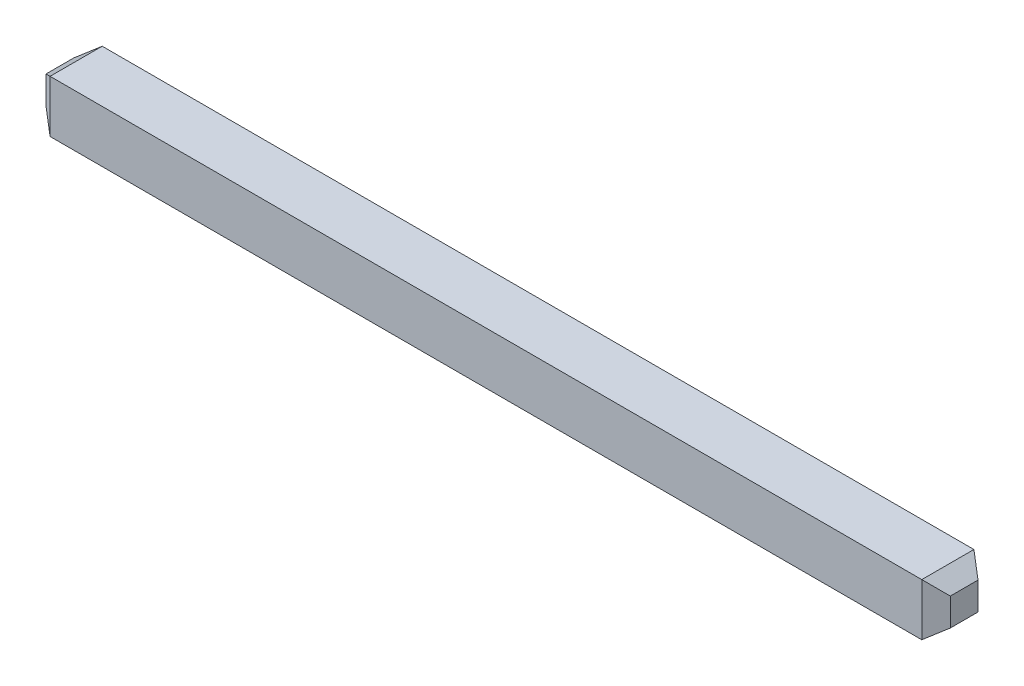
ISO-10303-21;
HEADER;
FILE_DESCRIPTION(('STEP AP214'),'2;1');
FILE_NAME('part.step','',(''),(''),'','','');
FILE_SCHEMA(('AUTOMOTIVE_DESIGN { 1 0 10303 214 1 1 1 1 }'));
ENDSEC;
DATA;
#1=APPLICATION_CONTEXT('core data for automotive mechanical design processes');
#2=APPLICATION_PROTOCOL_DEFINITION('international standard','automotive_design',2000,#1);
#3=PRODUCT_CONTEXT('',#1,'mechanical');
#4=PRODUCT('Part','Part','',(#3));
#5=PRODUCT_RELATED_PRODUCT_CATEGORY('part','',(#4));
#6=PRODUCT_DEFINITION_FORMATION('','',#4);
#7=PRODUCT_DEFINITION_CONTEXT('part definition',#1,'design');
#8=PRODUCT_DEFINITION('design','',#6,#7);
#9=PRODUCT_DEFINITION_SHAPE('','',#8);
#10=(LENGTH_UNIT() NAMED_UNIT(*) SI_UNIT(.MILLI.,.METRE.));
#11=(NAMED_UNIT(*) PLANE_ANGLE_UNIT() SI_UNIT($,.RADIAN.));
#12=(NAMED_UNIT(*) SI_UNIT($,.STERADIAN.) SOLID_ANGLE_UNIT());
#13=UNCERTAINTY_MEASURE_WITH_UNIT(LENGTH_MEASURE(1.E-05),#10,'distance_accuracy_value','');
#14=(GEOMETRIC_REPRESENTATION_CONTEXT(3) GLOBAL_UNCERTAINTY_ASSIGNED_CONTEXT((#13)) GLOBAL_UNIT_ASSIGNED_CONTEXT((#10,
#11,#12)) REPRESENTATION_CONTEXT('',''));
#15=CARTESIAN_POINT('',(0.,0.,0.));
#16=DIRECTION('',(0.,0.,1.));
#17=DIRECTION('',(1.,0.,0.));
#18=AXIS2_PLACEMENT_3D('',#15,#16,#17);
#19=CARTESIAN_POINT('',(-2.4,1.23,-34.535));
#20=DIRECTION('',(0.5999999999908,0.,0.8000000000069));
#21=DIRECTION('',(0.8000000000069,0.,-0.5999999999908));
#22=AXIS2_PLACEMENT_3D('',#19,#20,#21);
#23=PLANE('',#22);
#24=DIRECTION('',(0.,1.,0.));
#25=VECTOR('',#24,1.);
#26=CARTESIAN_POINT('',(-2.3,1.23,-34.61));
#27=LINE('',#26,#25);
#28=CARTESIAN_POINT('',(-2.29999999999957,1.55,-34.6099999999994));
#29=VERTEX_POINT('',#28);
#30=CARTESIAN_POINT('',(-2.29999999999958,0.909999999999898,-34.6099999999994));
#31=VERTEX_POINT('',#30);
#32=EDGE_CURVE('E101',#29,#31,#27,.F.);
#33=ORIENTED_EDGE('',*,*,#32,.T.);
#34=DIRECTION('',(-0.685994340569495,0.514495755428344,0.514495755427429));
#35=VECTOR('',#34,1.);
#36=CARTESIAN_POINT('',(-2.30000000000009,0.909999999999786,-34.61));
#37=LINE('',#36,#35);
#38=CARTESIAN_POINT('',(-2.50000000000021,1.06000000000001,-34.4600000000003));
#39=VERTEX_POINT('',#38);
#40=EDGE_CURVE('E85',#31,#39,#37,.T.);
#41=ORIENTED_EDGE('',*,*,#40,.T.);
#42=DIRECTION('',(0.,1.,0.));
#43=VECTOR('',#42,1.);
#44=CARTESIAN_POINT('',(-2.5,1.23,-34.46));
#45=LINE('',#44,#43);
#46=CARTESIAN_POINT('',(-2.50000000000043,1.4,-34.4600000000006));
#47=VERTEX_POINT('',#46);
#48=EDGE_CURVE('E79',#39,#47,#45,.T.);
#49=ORIENTED_EDGE('',*,*,#48,.T.);
#50=DIRECTION('',(-0.685994340570038,-0.514495755427529,0.51449575542752));
#51=VECTOR('',#50,1.);
#52=CARTESIAN_POINT('',(-2.3,1.55,-34.61));
#53=LINE('',#52,#51);
#54=EDGE_CURVE('E20',#29,#47,#53,.T.);
#55=ORIENTED_EDGE('',*,*,#54,.F.);
#56=EDGE_LOOP('',(#33,#41,#49,#55));
#57=FACE_BOUND('',#56,.T.);
#58=ADVANCED_FACE('F17',(#57),#23,.F.);
#59=CARTESIAN_POINT('',(8.5,1.23,-34.535));
#60=DIRECTION('',(-0.5999999999908,0.,0.8000000000069));
#61=DIRECTION('',(0.8000000000069,0.,0.5999999999908));
#62=AXIS2_PLACEMENT_3D('',#59,#60,#61);
#63=PLANE('',#62);
#64=DIRECTION('',(0.,1.,0.));
#65=VECTOR('',#64,1.);
#66=CARTESIAN_POINT('',(8.6,1.23,-34.46));
#67=LINE('',#66,#65);
#68=CARTESIAN_POINT('',(8.6000000000002,1.06000000000003,-34.4600000000003));
#69=VERTEX_POINT('',#68);
#70=CARTESIAN_POINT('',(8.60000000000043,1.4,-34.4600000000006));
#71=VERTEX_POINT('',#70);
#72=EDGE_CURVE('E113',#69,#71,#67,.T.);
#73=ORIENTED_EDGE('',*,*,#72,.F.);
#74=DIRECTION('',(-0.685994340569496,-0.514495755428343,-0.514495755427429));
#75=VECTOR('',#74,1.);
#76=CARTESIAN_POINT('',(8.59999999999996,1.06000000000005,-34.46));
#77=LINE('',#76,#75);
#78=CARTESIAN_POINT('',(8.39999999999959,0.909999999999884,-34.6099999999994));
#79=VERTEX_POINT('',#78);
#80=EDGE_CURVE('E108',#69,#79,#77,.T.);
#81=ORIENTED_EDGE('',*,*,#80,.T.);
#82=DIRECTION('',(0.,1.,0.));
#83=VECTOR('',#82,1.);
#84=CARTESIAN_POINT('',(8.4,1.23,-34.61));
#85=LINE('',#84,#83);
#86=CARTESIAN_POINT('',(8.39999999999957,1.55,-34.6099999999994));
#87=VERTEX_POINT('',#86);
#88=EDGE_CURVE('E99',#79,#87,#85,.T.);
#89=ORIENTED_EDGE('',*,*,#88,.T.);
#90=DIRECTION('',(-0.685994340570037,0.514495755427528,-0.514495755427522));
#91=VECTOR('',#90,1.);
#92=CARTESIAN_POINT('',(8.6,1.4,-34.46));
#93=LINE('',#92,#91);
#94=EDGE_CURVE('E116',#71,#87,#93,.T.);
#95=ORIENTED_EDGE('',*,*,#94,.F.);
#96=EDGE_LOOP('',(#73,#81,#89,#95));
#97=FACE_BOUND('',#96,.T.);
#98=ADVANCED_FACE('F214',(#97),#63,.F.);
#99=CARTESIAN_POINT('',(-2.4,1.475,-34.29));
#100=DIRECTION('',(-0.6,0.8,0.));
#101=DIRECTION('',(-0.8,-0.6,0.));
#102=AXIS2_PLACEMENT_3D('',#99,#100,#101);
#103=PLANE('',#102);
#104=DIRECTION('',(-0.685994340575991,-0.514495755427524,-0.514495755419589));
#105=VECTOR('',#104,1.);
#106=CARTESIAN_POINT('',(-2.29999999999913,1.55,-33.9700000000012));
#107=LINE('',#106,#105);
#108=CARTESIAN_POINT('',(-2.29999999999989,1.55,-33.9700000000001));
#109=VERTEX_POINT('',#108);
#110=CARTESIAN_POINT('',(-2.50000000000022,1.4,-34.1199999999997));
#111=VERTEX_POINT('',#110);
#112=EDGE_CURVE('E128',#109,#111,#107,.T.);
#113=ORIENTED_EDGE('',*,*,#112,.F.);
#114=DIRECTION('',(0.,0.,1.));
#115=VECTOR('',#114,1.);
#116=CARTESIAN_POINT('',(-2.3,1.55,-34.29));
#117=LINE('',#116,#115);
#118=EDGE_CURVE('E93',#29,#109,#117,.T.);
#119=ORIENTED_EDGE('',*,*,#118,.F.);
#120=ORIENTED_EDGE('',*,*,#54,.T.);
#121=DIRECTION('',(0.,0.,-1.));
#122=VECTOR('',#121,1.);
#123=CARTESIAN_POINT('',(-2.5,1.4,-34.29));
#124=LINE('',#123,#122);
#125=EDGE_CURVE('E87',#47,#111,#124,.F.);
#126=ORIENTED_EDGE('',*,*,#125,.T.);
#127=EDGE_LOOP('',(#113,#119,#120,#126));
#128=FACE_BOUND('',#127,.T.);
#129=ADVANCED_FACE('F90',(#128),#103,.T.);
#130=CARTESIAN_POINT('',(-2.5,1.23,-34.29));
#131=DIRECTION('',(1.,0.,0.));
#132=DIRECTION('',(0.,0.,-1.));
#133=AXIS2_PLACEMENT_3D('',#130,#131,#132);
#134=PLANE('',#133);
#135=DIRECTION('',(0.,1.,0.));
#136=VECTOR('',#135,1.);
#137=CARTESIAN_POINT('',(-2.50000000000086,1.23,-34.1199999999988));
#138=LINE('',#137,#136);
#139=CARTESIAN_POINT('',(-2.50000000000021,1.06000000000001,-34.1199999999997));
#140=VERTEX_POINT('',#139);
#141=EDGE_CURVE('E97',#111,#140,#138,.F.);
#142=ORIENTED_EDGE('',*,*,#141,.F.);
#143=ORIENTED_EDGE('',*,*,#125,.F.);
#144=ORIENTED_EDGE('',*,*,#48,.F.);
#145=DIRECTION('',(0.,0.,1.));
#146=VECTOR('',#145,1.);
#147=CARTESIAN_POINT('',(-2.49999999999996,1.06000000000005,-34.29));
#148=LINE('',#147,#146);
#149=EDGE_CURVE('E105',#39,#140,#148,.T.);
#150=ORIENTED_EDGE('',*,*,#149,.T.);
#151=EDGE_LOOP('',(#142,#143,#144,#150));
#152=FACE_BOUND('',#151,.T.);
#153=ADVANCED_FACE('F95',(#152),#134,.F.);
#154=CARTESIAN_POINT('',(3.05,1.23,-34.61));
#155=DIRECTION('',(0.,0.,1.));
#156=DIRECTION('',(1.,0.,0.));
#157=AXIS2_PLACEMENT_3D('',#154,#155,#156);
#158=PLANE('',#157);
#159=ORIENTED_EDGE('',*,*,#32,.F.);
#160=DIRECTION('',(1.,0.,0.));
#161=VECTOR('',#160,1.);
#162=CARTESIAN_POINT('',(3.05,1.55,-34.61));
#163=LINE('',#162,#161);
#164=EDGE_CURVE('E122',#87,#29,#163,.F.);
#165=ORIENTED_EDGE('',*,*,#164,.F.);
#166=ORIENTED_EDGE('',*,*,#88,.F.);
#167=DIRECTION('',(1.,0.,0.));
#168=VECTOR('',#167,1.);
#169=CARTESIAN_POINT('',(3.05,0.91,-34.61));
#170=LINE('',#169,#168);
#171=EDGE_CURVE('E136',#79,#31,#170,.F.);
#172=ORIENTED_EDGE('',*,*,#171,.T.);
#173=EDGE_LOOP('',(#159,#165,#166,#172));
#174=FACE_BOUND('',#173,.T.);
#175=ADVANCED_FACE('F182',(#174),#158,.F.);
#176=CARTESIAN_POINT('',(-2.4,0.9849999999999,-34.29));
#177=DIRECTION('',(0.600000000000912,0.799999999999316,0.));
#178=DIRECTION('',(-0.799999999999316,0.600000000000912,0.));
#179=AXIS2_PLACEMENT_3D('',#176,#177,#178);
#180=PLANE('',#179);
#181=DIRECTION('',(0.,0.,1.));
#182=VECTOR('',#181,1.);
#183=CARTESIAN_POINT('',(-2.3,0.91,-34.29));
#184=LINE('',#183,#182);
#185=CARTESIAN_POINT('',(-2.29999999999982,0.909999999999856,-33.9700000000003));
#186=VERTEX_POINT('',#185);
#187=EDGE_CURVE('E139',#31,#186,#184,.T.);
#188=ORIENTED_EDGE('',*,*,#187,.T.);
#189=DIRECTION('',(0.685994340575869,-0.514495755427776,0.514495755419498));
#190=VECTOR('',#189,1.);
#191=CARTESIAN_POINT('',(-2.50000000000086,1.06,-34.1199999999988));
#192=LINE('',#191,#190);
#193=EDGE_CURVE('E131',#140,#186,#192,.T.);
#194=ORIENTED_EDGE('',*,*,#193,.F.);
#195=ORIENTED_EDGE('',*,*,#149,.F.);
#196=ORIENTED_EDGE('',*,*,#40,.F.);
#197=EDGE_LOOP('',(#188,#194,#195,#196));
#198=FACE_BOUND('',#197,.T.);
#199=ADVANCED_FACE('F179',(#198),#180,.F.);
#200=CARTESIAN_POINT('',(8.5,0.9849999999999,-34.29));
#201=DIRECTION('',(-0.600000000000912,0.799999999999316,0.));
#202=DIRECTION('',(-0.799999999999316,-0.600000000000912,0.));
#203=AXIS2_PLACEMENT_3D('',#200,#201,#202);
#204=PLANE('',#203);
#205=DIRECTION('',(0.,0.,-1.));
#206=VECTOR('',#205,1.);
#207=CARTESIAN_POINT('',(8.6,1.06,-34.29));
#208=LINE('',#207,#206);
#209=CARTESIAN_POINT('',(8.6000000000002,1.06000000000003,-34.1199999999997));
#210=VERTEX_POINT('',#209);
#211=EDGE_CURVE('E110',#210,#69,#208,.T.);
#212=ORIENTED_EDGE('',*,*,#211,.F.);
#213=DIRECTION('',(0.685994340575869,0.514495755427777,-0.514495755419499));
#214=VECTOR('',#213,1.);
#215=CARTESIAN_POINT('',(8.39999999999913,0.9099999999999,-33.9700000000012));
#216=LINE('',#215,#214);
#217=CARTESIAN_POINT('',(8.39999999999993,0.909999999999868,-33.9700000000001));
#218=VERTEX_POINT('',#217);
#219=EDGE_CURVE('E35',#218,#210,#216,.T.);
#220=ORIENTED_EDGE('',*,*,#219,.F.);
#221=DIRECTION('',(0.,0.,1.));
#222=VECTOR('',#221,1.);
#223=CARTESIAN_POINT('',(8.4,0.91,-34.29));
#224=LINE('',#223,#222);
#225=EDGE_CURVE('E134',#218,#79,#224,.F.);
#226=ORIENTED_EDGE('',*,*,#225,.T.);
#227=ORIENTED_EDGE('',*,*,#80,.F.);
#228=EDGE_LOOP('',(#212,#220,#226,#227));
#229=FACE_BOUND('',#228,.T.);
#230=ADVANCED_FACE('F181',(#229),#204,.F.);
#231=CARTESIAN_POINT('',(8.6,1.23,-34.29));
#232=DIRECTION('',(1.,0.,0.));
#233=DIRECTION('',(0.,0.,-1.));
#234=AXIS2_PLACEMENT_3D('',#231,#232,#233);
#235=PLANE('',#234);
#236=ORIENTED_EDGE('',*,*,#72,.T.);
#237=DIRECTION('',(0.,0.,1.));
#238=VECTOR('',#237,1.);
#239=CARTESIAN_POINT('',(8.6,1.4,-34.29));
#240=LINE('',#239,#238);
#241=CARTESIAN_POINT('',(8.60000000000022,1.4,-34.1199999999997));
#242=VERTEX_POINT('',#241);
#243=EDGE_CURVE('E119',#242,#71,#240,.F.);
#244=ORIENTED_EDGE('',*,*,#243,.F.);
#245=DIRECTION('',(0.,1.,0.));
#246=VECTOR('',#245,1.);
#247=CARTESIAN_POINT('',(8.60000000000087,1.23,-34.1199999999988));
#248=LINE('',#247,#246);
#249=EDGE_CURVE('E142',#210,#242,#248,.T.);
#250=ORIENTED_EDGE('',*,*,#249,.F.);
#251=ORIENTED_EDGE('',*,*,#211,.T.);
#252=EDGE_LOOP('',(#236,#244,#250,#251));
#253=FACE_BOUND('',#252,.T.);
#254=ADVANCED_FACE('F189',(#253),#235,.T.);
#255=CARTESIAN_POINT('',(8.5,1.475,-34.29));
#256=DIRECTION('',(0.6,0.8,0.));
#257=DIRECTION('',(-0.8,0.6,0.));
#258=AXIS2_PLACEMENT_3D('',#255,#256,#257);
#259=PLANE('',#258);
#260=DIRECTION('',(-0.68599434057599,0.514495755427525,0.514495755419589));
#261=VECTOR('',#260,1.);
#262=CARTESIAN_POINT('',(8.60000000000087,1.4,-34.1199999999988));
#263=LINE('',#262,#261);
#264=CARTESIAN_POINT('',(8.39999999999989,1.55,-33.9700000000001));
#265=VERTEX_POINT('',#264);
#266=EDGE_CURVE('E145',#242,#265,#263,.T.);
#267=ORIENTED_EDGE('',*,*,#266,.F.);
#268=ORIENTED_EDGE('',*,*,#243,.T.);
#269=ORIENTED_EDGE('',*,*,#94,.T.);
#270=DIRECTION('',(0.,0.,1.));
#271=VECTOR('',#270,1.);
#272=CARTESIAN_POINT('',(8.4,1.55,-34.29));
#273=LINE('',#272,#271);
#274=EDGE_CURVE('E125',#265,#87,#273,.F.);
#275=ORIENTED_EDGE('',*,*,#274,.F.);
#276=EDGE_LOOP('',(#267,#268,#269,#275));
#277=FACE_BOUND('',#276,.T.);
#278=ADVANCED_FACE('F170',(#277),#259,.T.);
#279=CARTESIAN_POINT('',(3.05,1.55,-34.29));
#280=DIRECTION('',(0.,1.,0.));
#281=DIRECTION('',(0.,0.,1.));
#282=AXIS2_PLACEMENT_3D('',#279,#280,#281);
#283=PLANE('',#282);
#284=DIRECTION('',(1.,0.,0.));
#285=VECTOR('',#284,1.);
#286=CARTESIAN_POINT('',(3.05,1.55,-33.97));
#287=LINE('',#286,#285);
#288=EDGE_CURVE('E148',#265,#109,#287,.F.);
#289=ORIENTED_EDGE('',*,*,#288,.F.);
#290=ORIENTED_EDGE('',*,*,#274,.T.);
#291=ORIENTED_EDGE('',*,*,#164,.T.);
#292=ORIENTED_EDGE('',*,*,#118,.T.);
#293=EDGE_LOOP('',(#289,#290,#291,#292));
#294=FACE_BOUND('',#293,.T.);
#295=ADVANCED_FACE('F173',(#294),#283,.T.);
#296=CARTESIAN_POINT('',(-2.4,1.23,-34.045));
#297=DIRECTION('',(-0.599999999990736,0.,0.800000000006948));
#298=DIRECTION('',(0.800000000006948,0.,0.599999999990736));
#299=AXIS2_PLACEMENT_3D('',#296,#297,#298);
#300=PLANE('',#299);
#301=ORIENTED_EDGE('',*,*,#193,.T.);
#302=DIRECTION('',(0.,1.,0.));
#303=VECTOR('',#302,1.);
#304=CARTESIAN_POINT('',(-2.3,1.23,-33.97));
#305=LINE('',#304,#303);
#306=EDGE_CURVE('E151',#109,#186,#305,.F.);
#307=ORIENTED_EDGE('',*,*,#306,.F.);
#308=ORIENTED_EDGE('',*,*,#112,.T.);
#309=ORIENTED_EDGE('',*,*,#141,.T.);
#310=EDGE_LOOP('',(#301,#307,#308,#309));
#311=FACE_BOUND('',#310,.T.);
#312=ADVANCED_FACE('F176',(#311),#300,.T.);
#313=CARTESIAN_POINT('',(3.05,0.91,-34.29));
#314=DIRECTION('',(0.,1.,0.));
#315=DIRECTION('',(0.,0.,1.));
#316=AXIS2_PLACEMENT_3D('',#313,#314,#315);
#317=PLANE('',#316);
#318=ORIENTED_EDGE('',*,*,#187,.F.);
#319=ORIENTED_EDGE('',*,*,#171,.F.);
#320=ORIENTED_EDGE('',*,*,#225,.F.);
#321=DIRECTION('',(1.,0.,0.));
#322=VECTOR('',#321,1.);
#323=CARTESIAN_POINT('',(3.05,0.9099999999999,-33.97));
#324=LINE('',#323,#322);
#325=EDGE_CURVE('E26',#186,#218,#324,.T.);
#326=ORIENTED_EDGE('',*,*,#325,.F.);
#327=EDGE_LOOP('',(#318,#319,#320,#326));
#328=FACE_BOUND('',#327,.T.);
#329=ADVANCED_FACE('F162',(#328),#317,.F.);
#330=CARTESIAN_POINT('',(8.5,1.23,-34.045));
#331=DIRECTION('',(0.599999999990736,0.,0.800000000006948));
#332=DIRECTION('',(0.800000000006948,0.,-0.599999999990736));
#333=AXIS2_PLACEMENT_3D('',#330,#331,#332);
#334=PLANE('',#333);
#335=ORIENTED_EDGE('',*,*,#266,.T.);
#336=DIRECTION('',(0.,1.,0.));
#337=VECTOR('',#336,1.);
#338=CARTESIAN_POINT('',(8.4,1.23,-33.97));
#339=LINE('',#338,#337);
#340=EDGE_CURVE('E11',#218,#265,#339,.T.);
#341=ORIENTED_EDGE('',*,*,#340,.F.);
#342=ORIENTED_EDGE('',*,*,#219,.T.);
#343=ORIENTED_EDGE('',*,*,#249,.T.);
#344=EDGE_LOOP('',(#335,#341,#342,#343));
#345=FACE_BOUND('',#344,.T.);
#346=ADVANCED_FACE('F166',(#345),#334,.T.);
#347=CARTESIAN_POINT('',(3.05,1.23,-33.97));
#348=DIRECTION('',(0.,0.,1.));
#349=DIRECTION('',(1.,0.,0.));
#350=AXIS2_PLACEMENT_3D('',#347,#348,#349);
#351=PLANE('',#350);
#352=ORIENTED_EDGE('',*,*,#325,.T.);
#353=ORIENTED_EDGE('',*,*,#340,.T.);
#354=ORIENTED_EDGE('',*,*,#288,.T.);
#355=ORIENTED_EDGE('',*,*,#306,.T.);
#356=EDGE_LOOP('',(#352,#353,#354,#355));
#357=FACE_BOUND('',#356,.T.);
#358=ADVANCED_FACE('F157',(#357),#351,.T.);
#359=CLOSED_SHELL('',(#58,#98,#129,#153,#175,#199,#230,#254,#278,#295,#312,#329,#346,#358));
#360=MANIFOLD_SOLID_BREP('B1',#359);
#361=ADVANCED_BREP_SHAPE_REPRESENTATION('',(#18,#360),#14);
#362=SHAPE_DEFINITION_REPRESENTATION(#9,#361);
ENDSEC;
END-ISO-10303-21;
